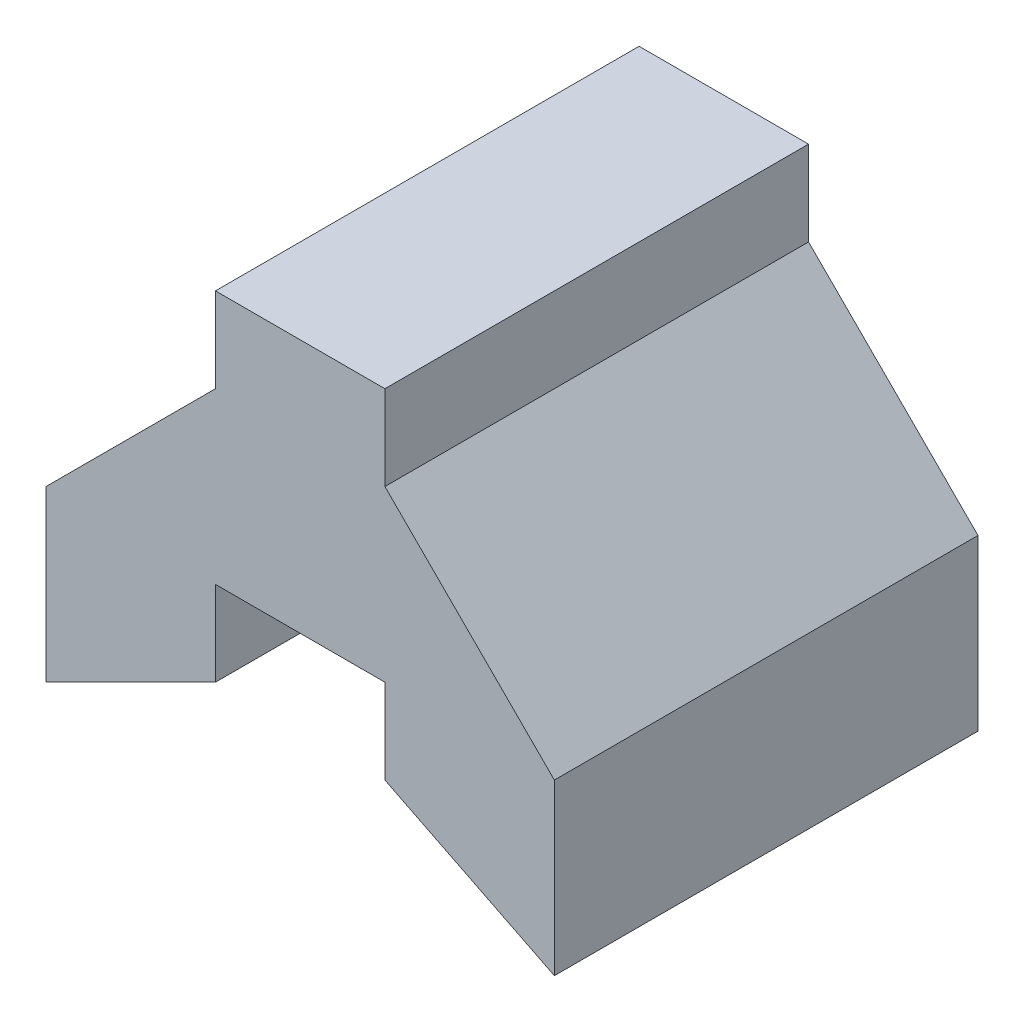
ISO-10303-21;
HEADER;
FILE_DESCRIPTION(('STEP AP214'),'2;1');
FILE_NAME('part.step','',(''),(''),'','','');
FILE_SCHEMA(('AUTOMOTIVE_DESIGN { 1 0 10303 214 1 1 1 1 }'));
ENDSEC;
DATA;
#1=APPLICATION_CONTEXT('core data for automotive mechanical design processes');
#2=APPLICATION_PROTOCOL_DEFINITION('international standard','automotive_design',2000,#1);
#3=PRODUCT_CONTEXT('',#1,'mechanical');
#4=PRODUCT('Part','Part','',(#3));
#5=PRODUCT_RELATED_PRODUCT_CATEGORY('part','',(#4));
#6=PRODUCT_DEFINITION_FORMATION('','',#4);
#7=PRODUCT_DEFINITION_CONTEXT('part definition',#1,'design');
#8=PRODUCT_DEFINITION('design','',#6,#7);
#9=PRODUCT_DEFINITION_SHAPE('','',#8);
#10=(LENGTH_UNIT() NAMED_UNIT(*) SI_UNIT(.MILLI.,.METRE.));
#11=(NAMED_UNIT(*) PLANE_ANGLE_UNIT() SI_UNIT($,.RADIAN.));
#12=(NAMED_UNIT(*) SI_UNIT($,.STERADIAN.) SOLID_ANGLE_UNIT());
#13=UNCERTAINTY_MEASURE_WITH_UNIT(LENGTH_MEASURE(1.E-05),#10,'distance_accuracy_value','');
#14=(GEOMETRIC_REPRESENTATION_CONTEXT(3) GLOBAL_UNCERTAINTY_ASSIGNED_CONTEXT((#13)) GLOBAL_UNIT_ASSIGNED_CONTEXT((#10,
#11,#12)) REPRESENTATION_CONTEXT('',''));
#15=CARTESIAN_POINT('',(0.,0.,0.));
#16=DIRECTION('',(0.,0.,1.));
#17=DIRECTION('',(1.,0.,0.));
#18=AXIS2_PLACEMENT_3D('',#15,#16,#17);
#19=CARTESIAN_POINT('',(0.,0.,5.));
#20=DIRECTION('',(0.,0.,-1.));
#21=DIRECTION('',(-1.,0.,0.));
#22=AXIS2_PLACEMENT_3D('',#19,#20,#21);
#23=PLANE('',#22);
#24=DIRECTION('',(0.,1.,0.));
#25=VECTOR('',#24,1.);
#26=CARTESIAN_POINT('',(0.,0.,5.));
#27=LINE('',#26,#25);
#28=CARTESIAN_POINT('',(0.,0.,5.));
#29=VERTEX_POINT('',#28);
#30=CARTESIAN_POINT('',(0.,1.,5.));
#31=VERTEX_POINT('',#30);
#32=EDGE_CURVE('E148',#29,#31,#27,.T.);
#33=ORIENTED_EDGE('',*,*,#32,.F.);
#34=DIRECTION('',(0.894427190999916,-0.447213595499958,0.));
#35=VECTOR('',#34,1.);
#36=CARTESIAN_POINT('',(2.,-1.,5.));
#37=LINE('',#36,#35);
#38=CARTESIAN_POINT('',(2.,-1.,5.));
#39=VERTEX_POINT('',#38);
#40=EDGE_CURVE('E165',#29,#39,#37,.T.);
#41=ORIENTED_EDGE('',*,*,#40,.T.);
#42=DIRECTION('',(0.,1.,0.));
#43=VECTOR('',#42,1.);
#44=CARTESIAN_POINT('',(2.,1.,5.));
#45=LINE('',#44,#43);
#46=CARTESIAN_POINT('',(2.,1.,5.));
#47=VERTEX_POINT('',#46);
#48=EDGE_CURVE('E98',#39,#47,#45,.T.);
#49=ORIENTED_EDGE('',*,*,#48,.T.);
#50=DIRECTION('',(-0.707106781186548,0.707106781186548,0.));
#51=VECTOR('',#50,1.);
#52=CARTESIAN_POINT('',(0.,3.,5.));
#53=LINE('',#52,#51);
#54=CARTESIAN_POINT('',(0.,3.,5.));
#55=VERTEX_POINT('',#54);
#56=EDGE_CURVE('E185',#47,#55,#53,.T.);
#57=ORIENTED_EDGE('',*,*,#56,.T.);
#58=DIRECTION('',(0.,1.,0.));
#59=VECTOR('',#58,1.);
#60=CARTESIAN_POINT('',(0.,4.,5.));
#61=LINE('',#60,#59);
#62=CARTESIAN_POINT('',(0.,4.,5.));
#63=VERTEX_POINT('',#62);
#64=EDGE_CURVE('E197',#55,#63,#61,.T.);
#65=ORIENTED_EDGE('',*,*,#64,.T.);
#66=DIRECTION('',(-1.,0.,0.));
#67=VECTOR('',#66,1.);
#68=CARTESIAN_POINT('',(-2.,4.,5.));
#69=LINE('',#68,#67);
#70=CARTESIAN_POINT('',(-2.,4.,5.));
#71=VERTEX_POINT('',#70);
#72=EDGE_CURVE('E121',#63,#71,#69,.T.);
#73=ORIENTED_EDGE('',*,*,#72,.T.);
#74=DIRECTION('',(0.,-1.,0.));
#75=VECTOR('',#74,1.);
#76=CARTESIAN_POINT('',(-2.,3.,5.));
#77=LINE('',#76,#75);
#78=CARTESIAN_POINT('',(-2.,3.,5.));
#79=VERTEX_POINT('',#78);
#80=EDGE_CURVE('E114',#71,#79,#77,.T.);
#81=ORIENTED_EDGE('',*,*,#80,.T.);
#82=DIRECTION('',(-0.707106781186548,-0.707106781186548,0.));
#83=VECTOR('',#82,1.);
#84=CARTESIAN_POINT('',(-4.,1.,5.));
#85=LINE('',#84,#83);
#86=CARTESIAN_POINT('',(-4.,1.,5.));
#87=VERTEX_POINT('',#86);
#88=EDGE_CURVE('E118',#79,#87,#85,.T.);
#89=ORIENTED_EDGE('',*,*,#88,.T.);
#90=DIRECTION('',(0.,-1.,0.));
#91=VECTOR('',#90,1.);
#92=CARTESIAN_POINT('',(-4.,-1.,5.));
#93=LINE('',#92,#91);
#94=CARTESIAN_POINT('',(-4.,-1.,5.));
#95=VERTEX_POINT('',#94);
#96=EDGE_CURVE('E50',#87,#95,#93,.T.);
#97=ORIENTED_EDGE('',*,*,#96,.T.);
#98=DIRECTION('',(0.894427190999916,0.447213595499958,0.));
#99=VECTOR('',#98,1.);
#100=CARTESIAN_POINT('',(-2.,0.,5.));
#101=LINE('',#100,#99);
#102=CARTESIAN_POINT('',(-2.,0.,5.));
#103=VERTEX_POINT('',#102);
#104=EDGE_CURVE('E138',#95,#103,#101,.T.);
#105=ORIENTED_EDGE('',*,*,#104,.T.);
#106=DIRECTION('',(0.,-1.,0.));
#107=VECTOR('',#106,1.);
#108=CARTESIAN_POINT('',(-2.,0.,5.));
#109=LINE('',#108,#107);
#110=CARTESIAN_POINT('',(-2.,1.,5.));
#111=VERTEX_POINT('',#110);
#112=EDGE_CURVE('E205',#111,#103,#109,.T.);
#113=ORIENTED_EDGE('',*,*,#112,.F.);
#114=DIRECTION('',(-1.,0.,0.));
#115=VECTOR('',#114,1.);
#116=CARTESIAN_POINT('',(-2.,1.,5.));
#117=LINE('',#116,#115);
#118=EDGE_CURVE('E209',#31,#111,#117,.T.);
#119=ORIENTED_EDGE('',*,*,#118,.F.);
#120=EDGE_LOOP('',(#33,#41,#49,#57,#65,#73,#81,#89,#97,#105,#113,#119));
#121=FACE_BOUND('',#120,.T.);
#122=ADVANCED_FACE('F33',(#121),#23,.F.);
#123=CARTESIAN_POINT('',(2.,-1.,5.));
#124=DIRECTION('',(0.447213595499958,0.894427190999916,0.));
#125=DIRECTION('',(-0.894427190999916,0.447213595499958,0.));
#126=AXIS2_PLACEMENT_3D('',#123,#124,#125);
#127=PLANE('',#126);
#128=DIRECTION('',(0.894427190999916,-0.447213595499958,0.));
#129=VECTOR('',#128,1.);
#130=CARTESIAN_POINT('',(2.,-1.,0.));
#131=LINE('',#130,#129);
#132=CARTESIAN_POINT('',(0.,0.,0.));
#133=VERTEX_POINT('',#132);
#134=CARTESIAN_POINT('',(2.,-1.,0.));
#135=VERTEX_POINT('',#134);
#136=EDGE_CURVE('E144',#133,#135,#131,.T.);
#137=ORIENTED_EDGE('',*,*,#136,.T.);
#138=DIRECTION('',(0.,0.,-1.));
#139=VECTOR('',#138,1.);
#140=CARTESIAN_POINT('',(2.,-1.,5.));
#141=LINE('',#140,#139);
#142=EDGE_CURVE('E11',#39,#135,#141,.T.);
#143=ORIENTED_EDGE('',*,*,#142,.F.);
#144=ORIENTED_EDGE('',*,*,#40,.F.);
#145=DIRECTION('',(0.,0.,-1.));
#146=VECTOR('',#145,1.);
#147=CARTESIAN_POINT('',(0.,0.,5.));
#148=LINE('',#147,#146);
#149=EDGE_CURVE('E143',#29,#133,#148,.T.);
#150=ORIENTED_EDGE('',*,*,#149,.T.);
#151=EDGE_LOOP('',(#137,#143,#144,#150));
#152=FACE_BOUND('',#151,.T.);
#153=ADVANCED_FACE('F35',(#152),#127,.F.);
#154=CARTESIAN_POINT('',(2.,1.,5.));
#155=DIRECTION('',(-1.,0.,0.));
#156=DIRECTION('',(0.,0.,1.));
#157=AXIS2_PLACEMENT_3D('',#154,#155,#156);
#158=PLANE('',#157);
#159=DIRECTION('',(0.,1.,0.));
#160=VECTOR('',#159,1.);
#161=CARTESIAN_POINT('',(2.,1.,0.));
#162=LINE('',#161,#160);
#163=CARTESIAN_POINT('',(2.,1.,0.));
#164=VERTEX_POINT('',#163);
#165=EDGE_CURVE('E147',#135,#164,#162,.T.);
#166=ORIENTED_EDGE('',*,*,#165,.T.);
#167=DIRECTION('',(0.,0.,-1.));
#168=VECTOR('',#167,1.);
#169=CARTESIAN_POINT('',(2.,1.,5.));
#170=LINE('',#169,#168);
#171=EDGE_CURVE('E42',#47,#164,#170,.T.);
#172=ORIENTED_EDGE('',*,*,#171,.F.);
#173=ORIENTED_EDGE('',*,*,#48,.F.);
#174=ORIENTED_EDGE('',*,*,#142,.T.);
#175=EDGE_LOOP('',(#166,#172,#173,#174));
#176=FACE_BOUND('',#175,.T.);
#177=ADVANCED_FACE('F252',(#176),#158,.F.);
#178=CARTESIAN_POINT('',(0.,3.,5.));
#179=DIRECTION('',(-0.707106781186548,-0.707106781186548,0.));
#180=DIRECTION('',(0.707106781186548,-0.707106781186548,0.));
#181=AXIS2_PLACEMENT_3D('',#178,#179,#180);
#182=PLANE('',#181);
#183=DIRECTION('',(-0.707106781186548,0.707106781186548,0.));
#184=VECTOR('',#183,1.);
#185=CARTESIAN_POINT('',(0.,3.,0.));
#186=LINE('',#185,#184);
#187=CARTESIAN_POINT('',(0.,3.,0.));
#188=VERTEX_POINT('',#187);
#189=EDGE_CURVE('E150',#164,#188,#186,.T.);
#190=ORIENTED_EDGE('',*,*,#189,.T.);
#191=DIRECTION('',(0.,0.,-1.));
#192=VECTOR('',#191,1.);
#193=CARTESIAN_POINT('',(0.,3.,5.));
#194=LINE('',#193,#192);
#195=EDGE_CURVE('E177',#55,#188,#194,.T.);
#196=ORIENTED_EDGE('',*,*,#195,.F.);
#197=ORIENTED_EDGE('',*,*,#56,.F.);
#198=ORIENTED_EDGE('',*,*,#171,.T.);
#199=EDGE_LOOP('',(#190,#196,#197,#198));
#200=FACE_BOUND('',#199,.T.);
#201=ADVANCED_FACE('F183',(#200),#182,.F.);
#202=CARTESIAN_POINT('',(0.,4.,5.));
#203=DIRECTION('',(-1.,0.,0.));
#204=DIRECTION('',(0.,0.,1.));
#205=AXIS2_PLACEMENT_3D('',#202,#203,#204);
#206=PLANE('',#205);
#207=DIRECTION('',(0.,1.,0.));
#208=VECTOR('',#207,1.);
#209=CARTESIAN_POINT('',(0.,4.,0.));
#210=LINE('',#209,#208);
#211=CARTESIAN_POINT('',(0.,4.,0.));
#212=VERTEX_POINT('',#211);
#213=EDGE_CURVE('E152',#188,#212,#210,.T.);
#214=ORIENTED_EDGE('',*,*,#213,.T.);
#215=DIRECTION('',(0.,0.,-1.));
#216=VECTOR('',#215,1.);
#217=CARTESIAN_POINT('',(0.,4.,5.));
#218=LINE('',#217,#216);
#219=EDGE_CURVE('E174',#63,#212,#218,.T.);
#220=ORIENTED_EDGE('',*,*,#219,.F.);
#221=ORIENTED_EDGE('',*,*,#64,.F.);
#222=ORIENTED_EDGE('',*,*,#195,.T.);
#223=EDGE_LOOP('',(#214,#220,#221,#222));
#224=FACE_BOUND('',#223,.T.);
#225=ADVANCED_FACE('F193',(#224),#206,.F.);
#226=CARTESIAN_POINT('',(-2.,4.,5.));
#227=DIRECTION('',(0.,-1.,0.));
#228=DIRECTION('',(0.,0.,-1.));
#229=AXIS2_PLACEMENT_3D('',#226,#227,#228);
#230=PLANE('',#229);
#231=DIRECTION('',(-1.,0.,0.));
#232=VECTOR('',#231,1.);
#233=CARTESIAN_POINT('',(-2.,4.,0.));
#234=LINE('',#233,#232);
#235=CARTESIAN_POINT('',(-2.,4.,0.));
#236=VERTEX_POINT('',#235);
#237=EDGE_CURVE('E154',#212,#236,#234,.T.);
#238=ORIENTED_EDGE('',*,*,#237,.T.);
#239=DIRECTION('',(0.,0.,-1.));
#240=VECTOR('',#239,1.);
#241=CARTESIAN_POINT('',(-2.,4.,5.));
#242=LINE('',#241,#240);
#243=EDGE_CURVE('E133',#71,#236,#242,.T.);
#244=ORIENTED_EDGE('',*,*,#243,.F.);
#245=ORIENTED_EDGE('',*,*,#72,.F.);
#246=ORIENTED_EDGE('',*,*,#219,.T.);
#247=EDGE_LOOP('',(#238,#244,#245,#246));
#248=FACE_BOUND('',#247,.T.);
#249=ADVANCED_FACE('F196',(#248),#230,.F.);
#250=CARTESIAN_POINT('',(-2.,3.,5.));
#251=DIRECTION('',(1.,0.,0.));
#252=DIRECTION('',(0.,0.,-1.));
#253=AXIS2_PLACEMENT_3D('',#250,#251,#252);
#254=PLANE('',#253);
#255=DIRECTION('',(0.,-1.,0.));
#256=VECTOR('',#255,1.);
#257=CARTESIAN_POINT('',(-2.,3.,0.));
#258=LINE('',#257,#256);
#259=CARTESIAN_POINT('',(-2.,3.,0.));
#260=VERTEX_POINT('',#259);
#261=EDGE_CURVE('E130',#236,#260,#258,.T.);
#262=ORIENTED_EDGE('',*,*,#261,.T.);
#263=DIRECTION('',(0.,0.,-1.));
#264=VECTOR('',#263,1.);
#265=CARTESIAN_POINT('',(-2.,3.,5.));
#266=LINE('',#265,#264);
#267=EDGE_CURVE('E127',#79,#260,#266,.T.);
#268=ORIENTED_EDGE('',*,*,#267,.F.);
#269=ORIENTED_EDGE('',*,*,#80,.F.);
#270=ORIENTED_EDGE('',*,*,#243,.T.);
#271=EDGE_LOOP('',(#262,#268,#269,#270));
#272=FACE_BOUND('',#271,.T.);
#273=ADVANCED_FACE('F128',(#272),#254,.F.);
#274=CARTESIAN_POINT('',(-4.,1.,5.));
#275=DIRECTION('',(0.707106781186548,-0.707106781186548,0.));
#276=DIRECTION('',(0.707106781186548,0.707106781186548,0.));
#277=AXIS2_PLACEMENT_3D('',#274,#275,#276);
#278=PLANE('',#277);
#279=DIRECTION('',(-0.707106781186548,-0.707106781186548,0.));
#280=VECTOR('',#279,1.);
#281=CARTESIAN_POINT('',(-4.,1.,0.));
#282=LINE('',#281,#280);
#283=CARTESIAN_POINT('',(-4.,1.,0.));
#284=VERTEX_POINT('',#283);
#285=EDGE_CURVE('E157',#260,#284,#282,.T.);
#286=ORIENTED_EDGE('',*,*,#285,.T.);
#287=DIRECTION('',(0.,0.,-1.));
#288=VECTOR('',#287,1.);
#289=CARTESIAN_POINT('',(-4.,1.,5.));
#290=LINE('',#289,#288);
#291=EDGE_CURVE('E134',#87,#284,#290,.T.);
#292=ORIENTED_EDGE('',*,*,#291,.F.);
#293=ORIENTED_EDGE('',*,*,#88,.F.);
#294=ORIENTED_EDGE('',*,*,#267,.T.);
#295=EDGE_LOOP('',(#286,#292,#293,#294));
#296=FACE_BOUND('',#295,.T.);
#297=ADVANCED_FACE('F136',(#296),#278,.F.);
#298=CARTESIAN_POINT('',(-4.,-1.,5.));
#299=DIRECTION('',(1.,0.,0.));
#300=DIRECTION('',(0.,0.,-1.));
#301=AXIS2_PLACEMENT_3D('',#298,#299,#300);
#302=PLANE('',#301);
#303=DIRECTION('',(0.,-1.,0.));
#304=VECTOR('',#303,1.);
#305=CARTESIAN_POINT('',(-4.,-1.,0.));
#306=LINE('',#305,#304);
#307=CARTESIAN_POINT('',(-4.,-1.,0.));
#308=VERTEX_POINT('',#307);
#309=EDGE_CURVE('E82',#284,#308,#306,.T.);
#310=ORIENTED_EDGE('',*,*,#309,.T.);
#311=DIRECTION('',(0.,0.,-1.));
#312=VECTOR('',#311,1.);
#313=CARTESIAN_POINT('',(-4.,-1.,5.));
#314=LINE('',#313,#312);
#315=EDGE_CURVE('E170',#95,#308,#314,.T.);
#316=ORIENTED_EDGE('',*,*,#315,.F.);
#317=ORIENTED_EDGE('',*,*,#96,.F.);
#318=ORIENTED_EDGE('',*,*,#291,.T.);
#319=EDGE_LOOP('',(#310,#316,#317,#318));
#320=FACE_BOUND('',#319,.T.);
#321=ADVANCED_FACE('F238',(#320),#302,.F.);
#322=CARTESIAN_POINT('',(-2.,0.,5.));
#323=DIRECTION('',(-0.447213595499958,0.894427190999916,0.));
#324=DIRECTION('',(-0.894427190999916,-0.447213595499958,0.));
#325=AXIS2_PLACEMENT_3D('',#322,#323,#324);
#326=PLANE('',#325);
#327=DIRECTION('',(0.894427190999916,0.447213595499958,0.));
#328=VECTOR('',#327,1.);
#329=CARTESIAN_POINT('',(-2.,0.,0.));
#330=LINE('',#329,#328);
#331=CARTESIAN_POINT('',(-2.,0.,0.));
#332=VERTEX_POINT('',#331);
#333=EDGE_CURVE('E160',#308,#332,#330,.T.);
#334=ORIENTED_EDGE('',*,*,#333,.T.);
#335=DIRECTION('',(0.,0.,-1.));
#336=VECTOR('',#335,1.);
#337=CARTESIAN_POINT('',(-2.,0.,5.));
#338=LINE('',#337,#336);
#339=EDGE_CURVE('E168',#103,#332,#338,.T.);
#340=ORIENTED_EDGE('',*,*,#339,.F.);
#341=ORIENTED_EDGE('',*,*,#104,.F.);
#342=ORIENTED_EDGE('',*,*,#315,.T.);
#343=EDGE_LOOP('',(#334,#340,#341,#342));
#344=FACE_BOUND('',#343,.T.);
#345=ADVANCED_FACE('F237',(#344),#326,.F.);
#346=CARTESIAN_POINT('',(0.,0.,0.));
#347=DIRECTION('',(0.,0.,-1.));
#348=DIRECTION('',(-1.,0.,0.));
#349=AXIS2_PLACEMENT_3D('',#346,#347,#348);
#350=PLANE('',#349);
#351=ORIENTED_EDGE('',*,*,#136,.F.);
#352=DIRECTION('',(1.,0.,0.));
#353=VECTOR('',#352,1.);
#354=CARTESIAN_POINT('',(0.,0.,0.));
#355=LINE('',#354,#353);
#356=EDGE_CURVE('E163',#332,#133,#355,.T.);
#357=ORIENTED_EDGE('',*,*,#356,.F.);
#358=ORIENTED_EDGE('',*,*,#333,.F.);
#359=ORIENTED_EDGE('',*,*,#309,.F.);
#360=ORIENTED_EDGE('',*,*,#285,.F.);
#361=ORIENTED_EDGE('',*,*,#261,.F.);
#362=ORIENTED_EDGE('',*,*,#237,.F.);
#363=ORIENTED_EDGE('',*,*,#213,.F.);
#364=ORIENTED_EDGE('',*,*,#189,.F.);
#365=ORIENTED_EDGE('',*,*,#165,.F.);
#366=EDGE_LOOP('',(#351,#357,#358,#359,#360,#361,#362,#363,#364,#365));
#367=FACE_BOUND('',#366,.T.);
#368=ADVANCED_FACE('F189',(#367),#350,.T.);
#369=CARTESIAN_POINT('',(0.,-0.961161351381841,5.39223227027637));
#370=DIRECTION('',(-1.,0.,0.));
#371=DIRECTION('',(0.,-1.,0.));
#372=AXIS2_PLACEMENT_3D('',#369,#370,#371);
#373=PLANE('',#372);
#374=ORIENTED_EDGE('',*,*,#149,.F.);
#375=ORIENTED_EDGE('',*,*,#32,.T.);
#376=DIRECTION('',(0.,0.196116135138184,0.98058067569092));
#377=VECTOR('',#376,1.);
#378=CARTESIAN_POINT('',(0.,1.,5.));
#379=LINE('',#378,#377);
#380=EDGE_CURVE('E211',#133,#31,#379,.T.);
#381=ORIENTED_EDGE('',*,*,#380,.F.);
#382=EDGE_LOOP('',(#374,#375,#381));
#383=FACE_BOUND('',#382,.T.);
#384=ADVANCED_FACE('F232',(#383),#373,.T.);
#385=CARTESIAN_POINT('',(-2.,-1.96116135138184,0.392232270276368));
#386=DIRECTION('',(1.,0.,0.));
#387=DIRECTION('',(0.,1.,0.));
#388=AXIS2_PLACEMENT_3D('',#385,#386,#387);
#389=PLANE('',#388);
#390=ORIENTED_EDGE('',*,*,#339,.T.);
#391=DIRECTION('',(0.,-0.196116135138184,-0.98058067569092));
#392=VECTOR('',#391,1.);
#393=CARTESIAN_POINT('',(-2.,0.,0.));
#394=LINE('',#393,#392);
#395=EDGE_CURVE('E90',#111,#332,#394,.T.);
#396=ORIENTED_EDGE('',*,*,#395,.F.);
#397=ORIENTED_EDGE('',*,*,#112,.T.);
#398=EDGE_LOOP('',(#390,#396,#397));
#399=FACE_BOUND('',#398,.T.);
#400=ADVANCED_FACE('F230',(#399),#389,.T.);
#401=CARTESIAN_POINT('',(0.,0.,0.));
#402=DIRECTION('',(0.,0.98058067569092,-0.196116135138184));
#403=DIRECTION('',(0.,0.196116135138184,0.98058067569092));
#404=AXIS2_PLACEMENT_3D('',#401,#402,#403);
#405=PLANE('',#404);
#406=ORIENTED_EDGE('',*,*,#356,.T.);
#407=ORIENTED_EDGE('',*,*,#380,.T.);
#408=ORIENTED_EDGE('',*,*,#118,.T.);
#409=ORIENTED_EDGE('',*,*,#395,.T.);
#410=EDGE_LOOP('',(#406,#407,#408,#409));
#411=FACE_BOUND('',#410,.T.);
#412=ADVANCED_FACE('F216',(#411),#405,.F.);
#413=CLOSED_SHELL('',(#122,#153,#177,#201,#225,#249,#273,#297,#321,#345,#368,#384,#400,#412));
#414=MANIFOLD_SOLID_BREP('B2',#413);
#415=ADVANCED_BREP_SHAPE_REPRESENTATION('',(#18,#414),#14);
#416=SHAPE_DEFINITION_REPRESENTATION(#9,#415);
ENDSEC;
END-ISO-10303-21;
